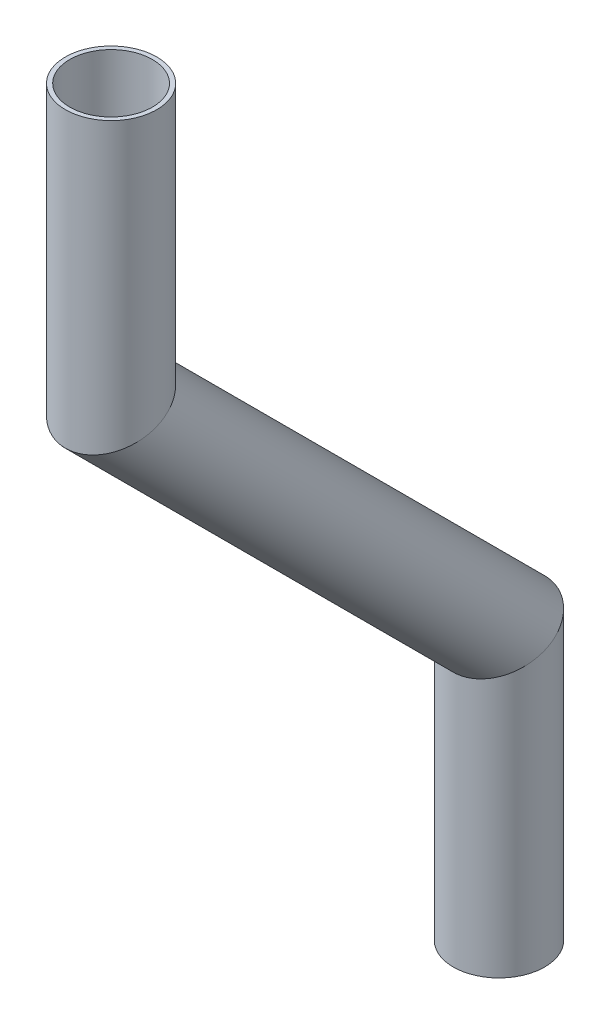
ISO-10303-21;
HEADER;
FILE_DESCRIPTION(('STEP AP214'),'2;1');
FILE_NAME('part.step','',(''),(''),'','','');
FILE_SCHEMA(('AUTOMOTIVE_DESIGN { 1 0 10303 214 1 1 1 1 }'));
ENDSEC;
DATA;
#1=APPLICATION_CONTEXT('core data for automotive mechanical design processes');
#2=APPLICATION_PROTOCOL_DEFINITION('international standard','automotive_design',2000,#1);
#3=PRODUCT_CONTEXT('',#1,'mechanical');
#4=PRODUCT('Part','Part','',(#3));
#5=PRODUCT_RELATED_PRODUCT_CATEGORY('part','',(#4));
#6=PRODUCT_DEFINITION_FORMATION('','',#4);
#7=PRODUCT_DEFINITION_CONTEXT('part definition',#1,'design');
#8=PRODUCT_DEFINITION('design','',#6,#7);
#9=PRODUCT_DEFINITION_SHAPE('','',#8);
#10=(LENGTH_UNIT() NAMED_UNIT(*) SI_UNIT(.MILLI.,.METRE.));
#11=(NAMED_UNIT(*) PLANE_ANGLE_UNIT() SI_UNIT($,.RADIAN.));
#12=(NAMED_UNIT(*) SI_UNIT($,.STERADIAN.) SOLID_ANGLE_UNIT());
#13=UNCERTAINTY_MEASURE_WITH_UNIT(LENGTH_MEASURE(1.E-05),#10,'distance_accuracy_value','');
#14=(GEOMETRIC_REPRESENTATION_CONTEXT(3) GLOBAL_UNCERTAINTY_ASSIGNED_CONTEXT((#13)) GLOBAL_UNIT_ASSIGNED_CONTEXT((#10,
#11,#12)) REPRESENTATION_CONTEXT('',''));
#15=CARTESIAN_POINT('',(0.,0.,0.));
#16=DIRECTION('',(0.,0.,1.));
#17=DIRECTION('',(1.,0.,0.));
#18=AXIS2_PLACEMENT_3D('',#15,#16,#17);
#19=CARTESIAN_POINT('',(0.,-93.0174135535431,302.572169570624));
#20=DIRECTION('',(0.,1.,0.));
#21=DIRECTION('',(0.,0.,1.));
#22=AXIS2_PLACEMENT_3D('',#19,#20,#21);
#23=CYLINDRICAL_SURFACE('',#22,5.74039999999998);
#24=CARTESIAN_POINT('',(0.,-54.9174135535431,302.572169570624));
#25=DIRECTION('',(0.,-1.,0.));
#26=DIRECTION('',(0.,0.,-1.));
#27=AXIS2_PLACEMENT_3D('',#24,#25,#26);
#28=CIRCLE('',#27,5.74039999999998);
#29=CARTESIAN_POINT('',(0.,-54.9174135535431,296.831769570624));
#30=VERTEX_POINT('',#29);
#31=EDGE_CURVE('E52',#30,#30,#28,.T.);
#32=ORIENTED_EDGE('',*,*,#31,.F.);
#33=EDGE_LOOP('',(#32));
#34=FACE_BOUND('',#33,.T.);
#35=CARTESIAN_POINT('',(0.,-93.0174135535431,302.572169570624));
#36=DIRECTION('',(0.,-0.923879532511286,-0.382683432365092));
#37=DIRECTION('',(0.,0.382683432365092,-0.923879532511286));
#38=AXIS2_PLACEMENT_3D('',#35,#36,#37);
#39=ELLIPSE('',#38,6.21336418655844,5.74039999999998);
#40=CARTESIAN_POINT('',(0.,-90.6396620200966,296.831769570624));
#41=VERTEX_POINT('',#40);
#42=EDGE_CURVE('E48',#41,#41,#39,.T.);
#43=ORIENTED_EDGE('',*,*,#42,.T.);
#44=EDGE_LOOP('',(#43));
#45=FACE_BOUND('',#44,.T.);
#46=ADVANCED_FACE('F44',(#34,#45),#23,.F.);
#47=CARTESIAN_POINT('',(0.,-93.0174135535431,302.572169570624));
#48=DIRECTION('',(0.,1.,0.));
#49=DIRECTION('',(0.,0.,1.));
#50=AXIS2_PLACEMENT_3D('',#47,#48,#49);
#51=CYLINDRICAL_SURFACE('',#50,6.35);
#52=CARTESIAN_POINT('',(0.,-54.9174135535431,302.572169570624));
#53=DIRECTION('',(0.,-1.,0.));
#54=DIRECTION('',(0.,0.,-1.));
#55=AXIS2_PLACEMENT_3D('',#52,#53,#54);
#56=CIRCLE('',#55,6.35);
#57=CARTESIAN_POINT('',(0.,-54.9174135535431,296.222169570624));
#58=VERTEX_POINT('',#57);
#59=EDGE_CURVE('E56',#58,#58,#56,.T.);
#60=ORIENTED_EDGE('',*,*,#59,.T.);
#61=EDGE_LOOP('',(#60));
#62=FACE_BOUND('',#61,.T.);
#63=CARTESIAN_POINT('',(0.,-93.0174135535431,302.572169570624));
#64=DIRECTION('',(0.,-0.923879532511286,-0.382683432365092));
#65=DIRECTION('',(0.,0.382683432365092,-0.923879532511286));
#66=AXIS2_PLACEMENT_3D('',#63,#64,#65);
#67=ELLIPSE('',#66,6.8731904718567,6.35);
#68=CARTESIAN_POINT('',(0.,-90.3871574324739,296.222169570624));
#69=VERTEX_POINT('',#68);
#70=EDGE_CURVE('E12',#69,#69,#67,.T.);
#71=ORIENTED_EDGE('',*,*,#70,.F.);
#72=EDGE_LOOP('',(#71));
#73=FACE_BOUND('',#72,.T.);
#74=ADVANCED_FACE('F71',(#62,#73),#51,.T.);
#75=CARTESIAN_POINT('',(0.,-54.9174135535431,302.572169570624));
#76=DIRECTION('',(0.,-1.,0.));
#77=DIRECTION('',(0.,0.,-1.));
#78=AXIS2_PLACEMENT_3D('',#75,#76,#77);
#79=PLANE('',#78);
#80=ORIENTED_EDGE('',*,*,#31,.T.);
#81=EDGE_LOOP('',(#80));
#82=FACE_BOUND('',#81,.T.);
#83=ORIENTED_EDGE('',*,*,#59,.F.);
#84=EDGE_LOOP('',(#83));
#85=FACE_BOUND('',#84,.T.);
#86=ADVANCED_FACE('F67',(#82,#85),#79,.F.);
#87=CARTESIAN_POINT('',(0.,-93.0174135535431,302.572169570624));
#88=DIRECTION('',(0.,-0.923879532511286,-0.382683432365092));
#89=DIRECTION('',(0.,0.382683432365092,-0.923879532511286));
#90=AXIS2_PLACEMENT_3D('',#87,#88,#89);
#91=PLANE('',#90);
#92=ORIENTED_EDGE('',*,*,#42,.F.);
#93=EDGE_LOOP('',(#92));
#94=FACE_BOUND('',#93,.T.);
#95=ORIENTED_EDGE('',*,*,#70,.T.);
#96=EDGE_LOOP('',(#95));
#97=FACE_BOUND('',#96,.T.);
#98=ADVANCED_FACE('F46',(#94,#97),#91,.T.);
#99=CLOSED_SHELL('',(#46,#74,#86,#98));
#100=MANIFOLD_SOLID_BREP('B2',#99);
#101=CARTESIAN_POINT('',(0.,-146.898950279958,248.690632844209));
#102=DIRECTION('',(0.,0.707106781186546,0.707106781186549));
#103=DIRECTION('',(0.,-0.707106781186549,0.707106781186546));
#104=AXIS2_PLACEMENT_3D('',#101,#102,#103);
#105=CYLINDRICAL_SURFACE('',#104,5.74039999999998);
#106=CARTESIAN_POINT('',(0.,-146.898950279958,248.690632844209));
#107=DIRECTION('',(0.,-0.923879532511286,-0.382683432365092));
#108=DIRECTION('',(0.,-0.382683432365092,0.923879532511286));
#109=AXIS2_PLACEMENT_3D('',#106,#107,#108);
#110=ELLIPSE('',#109,6.21336418655844,5.74039999999998);
#111=CARTESIAN_POINT('',(0.,-149.276701813404,254.431032844209));
#112=VERTEX_POINT('',#111);
#113=EDGE_CURVE('E145',#112,#112,#110,.T.);
#114=ORIENTED_EDGE('',*,*,#113,.T.);
#115=EDGE_LOOP('',(#114));
#116=FACE_BOUND('',#115,.T.);
#117=CARTESIAN_POINT('',(0.,-93.0174135535431,302.572169570624));
#118=DIRECTION('',(0.,0.923879532511286,0.382683432365092));
#119=DIRECTION('',(0.,-0.382683432365092,0.923879532511286));
#120=AXIS2_PLACEMENT_3D('',#117,#118,#119);
#121=ELLIPSE('',#120,6.21336418655844,5.74039999999998);
#122=CARTESIAN_POINT('',(0.,-95.3951650869896,308.312569570624));
#123=VERTEX_POINT('',#122);
#124=EDGE_CURVE('E135',#123,#123,#121,.T.);
#125=ORIENTED_EDGE('',*,*,#124,.T.);
#126=EDGE_LOOP('',(#125));
#127=FACE_BOUND('',#126,.T.);
#128=ADVANCED_FACE('F131',(#116,#127),#105,.F.);
#129=CARTESIAN_POINT('',(0.,-146.898950279958,248.690632844209));
#130=DIRECTION('',(0.,0.707106781186546,0.707106781186549));
#131=DIRECTION('',(0.,-0.707106781186549,0.707106781186546));
#132=AXIS2_PLACEMENT_3D('',#129,#130,#131);
#133=CYLINDRICAL_SURFACE('',#132,6.35);
#134=CARTESIAN_POINT('',(0.,-146.898950279958,248.690632844209));
#135=DIRECTION('',(0.,-0.923879532511286,-0.382683432365092));
#136=DIRECTION('',(0.,-0.382683432365092,0.923879532511286));
#137=AXIS2_PLACEMENT_3D('',#134,#135,#136);
#138=ELLIPSE('',#137,6.8731904718567,6.35);
#139=CARTESIAN_POINT('',(0.,-149.529206401027,255.040632844209));
#140=VERTEX_POINT('',#139);
#141=EDGE_CURVE('E139',#140,#140,#138,.T.);
#142=ORIENTED_EDGE('',*,*,#141,.F.);
#143=EDGE_LOOP('',(#142));
#144=FACE_BOUND('',#143,.T.);
#145=CARTESIAN_POINT('',(0.,-93.0174135535431,302.572169570624));
#146=DIRECTION('',(0.,0.923879532511286,0.382683432365092));
#147=DIRECTION('',(0.,-0.382683432365092,0.923879532511286));
#148=AXIS2_PLACEMENT_3D('',#145,#146,#147);
#149=ELLIPSE('',#148,6.8731904718567,6.35);
#150=CARTESIAN_POINT('',(0.,-95.6476696746123,308.922169570624));
#151=VERTEX_POINT('',#150);
#152=EDGE_CURVE('E43',#151,#151,#149,.T.);
#153=ORIENTED_EDGE('',*,*,#152,.F.);
#154=EDGE_LOOP('',(#153));
#155=FACE_BOUND('',#154,.T.);
#156=ADVANCED_FACE('F158',(#144,#155),#133,.T.);
#157=CARTESIAN_POINT('',(0.,-146.898950279958,248.690632844209));
#158=DIRECTION('',(0.,-0.923879532511286,-0.382683432365092));
#159=DIRECTION('',(0.,0.382683432365092,-0.923879532511286));
#160=AXIS2_PLACEMENT_3D('',#157,#158,#159);
#161=PLANE('',#160);
#162=ORIENTED_EDGE('',*,*,#113,.F.);
#163=EDGE_LOOP('',(#162));
#164=FACE_BOUND('',#163,.T.);
#165=ORIENTED_EDGE('',*,*,#141,.T.);
#166=EDGE_LOOP('',(#165));
#167=FACE_BOUND('',#166,.T.);
#168=ADVANCED_FACE('F154',(#164,#167),#161,.T.);
#169=CARTESIAN_POINT('',(0.,-93.0174135535431,302.572169570624));
#170=DIRECTION('',(0.,0.923879532511286,0.382683432365092));
#171=DIRECTION('',(0.,-0.382683432365092,0.923879532511286));
#172=AXIS2_PLACEMENT_3D('',#169,#170,#171);
#173=PLANE('',#172);
#174=ORIENTED_EDGE('',*,*,#124,.F.);
#175=EDGE_LOOP('',(#174));
#176=FACE_BOUND('',#175,.T.);
#177=ORIENTED_EDGE('',*,*,#152,.T.);
#178=EDGE_LOOP('',(#177));
#179=FACE_BOUND('',#178,.T.);
#180=ADVANCED_FACE('F133',(#176,#179),#173,.T.);
#181=CLOSED_SHELL('',(#128,#156,#168,#180));
#182=MANIFOLD_SOLID_BREP('B7',#181);
#183=CARTESIAN_POINT('',(0.,-184.998950279959,248.690632844209));
#184=DIRECTION('',(0.,1.,0.));
#185=DIRECTION('',(0.,0.,1.));
#186=AXIS2_PLACEMENT_3D('',#183,#184,#185);
#187=CYLINDRICAL_SURFACE('',#186,5.74039999999998);
#188=CARTESIAN_POINT('',(0.,-184.998950279959,248.690632844209));
#189=DIRECTION('',(0.,-1.,0.));
#190=DIRECTION('',(0.,0.,-1.));
#191=AXIS2_PLACEMENT_3D('',#188,#189,#190);
#192=CIRCLE('',#191,5.74039999999998);
#193=CARTESIAN_POINT('',(0.,-184.998950279959,242.950232844209));
#194=VERTEX_POINT('',#193);
#195=EDGE_CURVE('E227',#194,#194,#192,.T.);
#196=ORIENTED_EDGE('',*,*,#195,.T.);
#197=EDGE_LOOP('',(#196));
#198=FACE_BOUND('',#197,.T.);
#199=CARTESIAN_POINT('',(0.,-146.898950279958,248.690632844209));
#200=DIRECTION('',(0.,0.923879532511286,0.382683432365092));
#201=DIRECTION('',(0.,0.382683432365092,-0.923879532511286));
#202=AXIS2_PLACEMENT_3D('',#199,#200,#201);
#203=ELLIPSE('',#202,6.21336418655845,5.74039999999998);
#204=CARTESIAN_POINT('',(0.,-144.521198746511,242.950232844209));
#205=VERTEX_POINT('',#204);
#206=EDGE_CURVE('E217',#205,#205,#203,.T.);
#207=ORIENTED_EDGE('',*,*,#206,.T.);
#208=EDGE_LOOP('',(#207));
#209=FACE_BOUND('',#208,.T.);
#210=ADVANCED_FACE('F213',(#198,#209),#187,.F.);
#211=CARTESIAN_POINT('',(0.,-184.998950279959,248.690632844209));
#212=DIRECTION('',(0.,1.,0.));
#213=DIRECTION('',(0.,0.,1.));
#214=AXIS2_PLACEMENT_3D('',#211,#212,#213);
#215=CYLINDRICAL_SURFACE('',#214,6.35);
#216=CARTESIAN_POINT('',(0.,-184.998950279959,248.690632844209));
#217=DIRECTION('',(0.,-1.,0.));
#218=DIRECTION('',(0.,0.,-1.));
#219=AXIS2_PLACEMENT_3D('',#216,#217,#218);
#220=CIRCLE('',#219,6.35);
#221=CARTESIAN_POINT('',(0.,-184.998950279959,242.340632844209));
#222=VERTEX_POINT('',#221);
#223=EDGE_CURVE('E221',#222,#222,#220,.T.);
#224=ORIENTED_EDGE('',*,*,#223,.F.);
#225=EDGE_LOOP('',(#224));
#226=FACE_BOUND('',#225,.T.);
#227=CARTESIAN_POINT('',(0.,-146.898950279958,248.690632844209));
#228=DIRECTION('',(0.,0.923879532511286,0.382683432365092));
#229=DIRECTION('',(0.,0.382683432365092,-0.923879532511286));
#230=AXIS2_PLACEMENT_3D('',#227,#228,#229);
#231=ELLIPSE('',#230,6.8731904718567,6.35);
#232=CARTESIAN_POINT('',(0.,-144.268694158889,242.340632844209));
#233=VERTEX_POINT('',#232);
#234=EDGE_CURVE('E130',#233,#233,#231,.T.);
#235=ORIENTED_EDGE('',*,*,#234,.F.);
#236=EDGE_LOOP('',(#235));
#237=FACE_BOUND('',#236,.T.);
#238=ADVANCED_FACE('F240',(#226,#237),#215,.T.);
#239=CARTESIAN_POINT('',(0.,-184.998950279959,248.690632844209));
#240=DIRECTION('',(0.,-1.,0.));
#241=DIRECTION('',(0.,0.,-1.));
#242=AXIS2_PLACEMENT_3D('',#239,#240,#241);
#243=PLANE('',#242);
#244=ORIENTED_EDGE('',*,*,#195,.F.);
#245=EDGE_LOOP('',(#244));
#246=FACE_BOUND('',#245,.T.);
#247=ORIENTED_EDGE('',*,*,#223,.T.);
#248=EDGE_LOOP('',(#247));
#249=FACE_BOUND('',#248,.T.);
#250=ADVANCED_FACE('F236',(#246,#249),#243,.T.);
#251=CARTESIAN_POINT('',(0.,-146.898950279958,248.690632844209));
#252=DIRECTION('',(0.,0.923879532511286,0.382683432365092));
#253=DIRECTION('',(0.,-0.382683432365092,0.923879532511286));
#254=AXIS2_PLACEMENT_3D('',#251,#252,#253);
#255=PLANE('',#254);
#256=ORIENTED_EDGE('',*,*,#206,.F.);
#257=EDGE_LOOP('',(#256));
#258=FACE_BOUND('',#257,.T.);
#259=ORIENTED_EDGE('',*,*,#234,.T.);
#260=EDGE_LOOP('',(#259));
#261=FACE_BOUND('',#260,.T.);
#262=ADVANCED_FACE('F215',(#258,#261),#255,.T.);
#263=CLOSED_SHELL('',(#210,#238,#250,#262));
#264=MANIFOLD_SOLID_BREP('B38',#263);
#265=ADVANCED_BREP_SHAPE_REPRESENTATION('',(#18,#100,#182,#264),#14);
#266=SHAPE_DEFINITION_REPRESENTATION(#9,#265);
ENDSEC;
END-ISO-10303-21;
